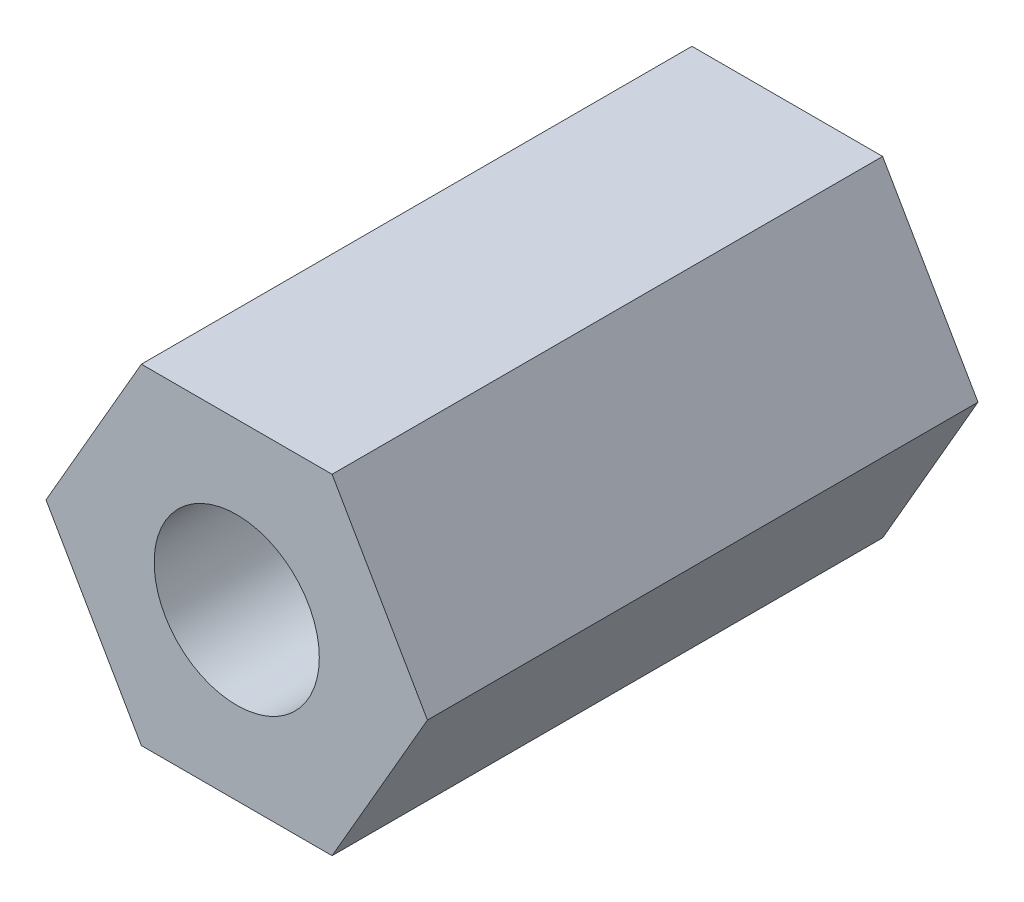
ISO-10303-21;
HEADER;
FILE_DESCRIPTION(('STEP AP214'),'2;1');
FILE_NAME('part.step','',(''),(''),'','','');
FILE_SCHEMA(('AUTOMOTIVE_DESIGN { 1 0 10303 214 1 1 1 1 }'));
ENDSEC;
DATA;
#1=APPLICATION_CONTEXT('core data for automotive mechanical design processes');
#2=APPLICATION_PROTOCOL_DEFINITION('international standard','automotive_design',2000,#1);
#3=PRODUCT_CONTEXT('',#1,'mechanical');
#4=PRODUCT('Part','Part','',(#3));
#5=PRODUCT_RELATED_PRODUCT_CATEGORY('part','',(#4));
#6=PRODUCT_DEFINITION_FORMATION('','',#4);
#7=PRODUCT_DEFINITION_CONTEXT('part definition',#1,'design');
#8=PRODUCT_DEFINITION('design','',#6,#7);
#9=PRODUCT_DEFINITION_SHAPE('','',#8);
#10=(LENGTH_UNIT() NAMED_UNIT(*) SI_UNIT(.MILLI.,.METRE.));
#11=(NAMED_UNIT(*) PLANE_ANGLE_UNIT() SI_UNIT($,.RADIAN.));
#12=(NAMED_UNIT(*) SI_UNIT($,.STERADIAN.) SOLID_ANGLE_UNIT());
#13=UNCERTAINTY_MEASURE_WITH_UNIT(LENGTH_MEASURE(1.E-05),#10,'distance_accuracy_value','');
#14=(GEOMETRIC_REPRESENTATION_CONTEXT(3) GLOBAL_UNCERTAINTY_ASSIGNED_CONTEXT((#13)) GLOBAL_UNIT_ASSIGNED_CONTEXT((#10,
#11,#12)) REPRESENTATION_CONTEXT('',''));
#15=CARTESIAN_POINT('',(0.,0.,0.));
#16=DIRECTION('',(0.,0.,1.));
#17=DIRECTION('',(1.,0.,0.));
#18=AXIS2_PLACEMENT_3D('',#15,#16,#17);
#19=CARTESIAN_POINT('',(0.,0.,10.));
#20=DIRECTION('',(0.,0.,1.));
#21=DIRECTION('',(1.,0.,0.));
#22=AXIS2_PLACEMENT_3D('',#19,#20,#21);
#23=PLANE('',#22);
#24=DIRECTION('',(0.5,0.866025403784439,0.));
#25=VECTOR('',#24,1.);
#26=CARTESIAN_POINT('',(1.73205080756888,-3.,10.));
#27=LINE('',#26,#25);
#28=CARTESIAN_POINT('',(1.73205080756888,-3.,10.));
#29=VERTEX_POINT('',#28);
#30=CARTESIAN_POINT('',(3.46410161513775,0.,10.));
#31=VERTEX_POINT('',#30);
#32=EDGE_CURVE('E130',#29,#31,#27,.T.);
#33=ORIENTED_EDGE('',*,*,#32,.T.);
#34=DIRECTION('',(-0.5,0.866025403784439,0.));
#35=VECTOR('',#34,1.);
#36=CARTESIAN_POINT('',(3.46410161513775,0.,10.));
#37=LINE('',#36,#35);
#38=CARTESIAN_POINT('',(1.73205080756888,3.,10.));
#39=VERTEX_POINT('',#38);
#40=EDGE_CURVE('E88',#31,#39,#37,.T.);
#41=ORIENTED_EDGE('',*,*,#40,.T.);
#42=DIRECTION('',(-1.,0.,0.));
#43=VECTOR('',#42,1.);
#44=CARTESIAN_POINT('',(1.73205080756888,3.,10.));
#45=LINE('',#44,#43);
#46=CARTESIAN_POINT('',(-1.73205080756888,3.,10.));
#47=VERTEX_POINT('',#46);
#48=EDGE_CURVE('E101',#39,#47,#45,.T.);
#49=ORIENTED_EDGE('',*,*,#48,.T.);
#50=DIRECTION('',(-0.5,-0.866025403784439,0.));
#51=VECTOR('',#50,1.);
#52=CARTESIAN_POINT('',(-1.73205080756888,3.,10.));
#53=LINE('',#52,#51);
#54=CARTESIAN_POINT('',(-3.46410161513775,0.,10.));
#55=VERTEX_POINT('',#54);
#56=EDGE_CURVE('E95',#47,#55,#53,.T.);
#57=ORIENTED_EDGE('',*,*,#56,.T.);
#58=DIRECTION('',(0.5,-0.866025403784439,0.));
#59=VECTOR('',#58,1.);
#60=CARTESIAN_POINT('',(-3.46410161513775,0.,10.));
#61=LINE('',#60,#59);
#62=CARTESIAN_POINT('',(-1.73205080756888,-3.,10.));
#63=VERTEX_POINT('',#62);
#64=EDGE_CURVE('E99',#55,#63,#61,.T.);
#65=ORIENTED_EDGE('',*,*,#64,.T.);
#66=DIRECTION('',(1.,0.,0.));
#67=VECTOR('',#66,1.);
#68=CARTESIAN_POINT('',(-1.73205080756888,-3.,10.));
#69=LINE('',#68,#67);
#70=EDGE_CURVE('E51',#63,#29,#69,.T.);
#71=ORIENTED_EDGE('',*,*,#70,.T.);
#72=EDGE_LOOP('',(#33,#41,#49,#57,#65,#71));
#73=FACE_BOUND('',#72,.T.);
#74=CARTESIAN_POINT('',(0.,0.,10.));
#75=DIRECTION('',(0.,0.,1.));
#76=DIRECTION('',(1.,0.,0.));
#77=AXIS2_PLACEMENT_3D('',#74,#75,#76);
#78=CIRCLE('',#77,1.5);
#79=CARTESIAN_POINT('',(1.5,0.,10.));
#80=VERTEX_POINT('',#79);
#81=EDGE_CURVE('E123',#80,#80,#78,.T.);
#82=ORIENTED_EDGE('',*,*,#81,.F.);
#83=EDGE_LOOP('',(#82));
#84=FACE_BOUND('',#83,.T.);
#85=ADVANCED_FACE('F34',(#73,#84),#23,.T.);
#86=CARTESIAN_POINT('',(0.,0.,0.));
#87=DIRECTION('',(0.,0.,1.));
#88=DIRECTION('',(1.,0.,0.));
#89=AXIS2_PLACEMENT_3D('',#86,#87,#88);
#90=PLANE('',#89);
#91=DIRECTION('',(0.5,0.866025403784439,0.));
#92=VECTOR('',#91,1.);
#93=CARTESIAN_POINT('',(1.73205080756888,-3.,0.));
#94=LINE('',#93,#92);
#95=CARTESIAN_POINT('',(1.73205080756888,-3.,0.));
#96=VERTEX_POINT('',#95);
#97=CARTESIAN_POINT('',(3.46410161513775,0.,0.));
#98=VERTEX_POINT('',#97);
#99=EDGE_CURVE('E119',#96,#98,#94,.T.);
#100=ORIENTED_EDGE('',*,*,#99,.F.);
#101=DIRECTION('',(1.,0.,0.));
#102=VECTOR('',#101,1.);
#103=CARTESIAN_POINT('',(-1.73205080756888,-3.,0.));
#104=LINE('',#103,#102);
#105=CARTESIAN_POINT('',(-1.73205080756888,-3.,0.));
#106=VERTEX_POINT('',#105);
#107=EDGE_CURVE('E80',#106,#96,#104,.T.);
#108=ORIENTED_EDGE('',*,*,#107,.F.);
#109=DIRECTION('',(0.5,-0.866025403784439,0.));
#110=VECTOR('',#109,1.);
#111=CARTESIAN_POINT('',(-3.46410161513775,0.,0.));
#112=LINE('',#111,#110);
#113=CARTESIAN_POINT('',(-3.46410161513775,0.,0.));
#114=VERTEX_POINT('',#113);
#115=EDGE_CURVE('E74',#114,#106,#112,.T.);
#116=ORIENTED_EDGE('',*,*,#115,.F.);
#117=DIRECTION('',(-0.5,-0.866025403784439,0.));
#118=VECTOR('',#117,1.);
#119=CARTESIAN_POINT('',(-1.73205080756888,3.,0.));
#120=LINE('',#119,#118);
#121=CARTESIAN_POINT('',(-1.73205080756888,3.,0.));
#122=VERTEX_POINT('',#121);
#123=EDGE_CURVE('E109',#122,#114,#120,.T.);
#124=ORIENTED_EDGE('',*,*,#123,.F.);
#125=DIRECTION('',(-1.,0.,0.));
#126=VECTOR('',#125,1.);
#127=CARTESIAN_POINT('',(1.73205080756888,3.,0.));
#128=LINE('',#127,#126);
#129=CARTESIAN_POINT('',(1.73205080756888,3.,0.));
#130=VERTEX_POINT('',#129);
#131=EDGE_CURVE('E125',#130,#122,#128,.T.);
#132=ORIENTED_EDGE('',*,*,#131,.F.);
#133=DIRECTION('',(-0.5,0.866025403784439,0.));
#134=VECTOR('',#133,1.);
#135=CARTESIAN_POINT('',(3.46410161513775,0.,0.));
#136=LINE('',#135,#134);
#137=EDGE_CURVE('E122',#98,#130,#136,.T.);
#138=ORIENTED_EDGE('',*,*,#137,.F.);
#139=EDGE_LOOP('',(#100,#108,#116,#124,#132,#138));
#140=FACE_BOUND('',#139,.T.);
#141=CARTESIAN_POINT('',(0.,0.,0.));
#142=DIRECTION('',(0.,0.,1.));
#143=DIRECTION('',(1.,0.,0.));
#144=AXIS2_PLACEMENT_3D('',#141,#142,#143);
#145=CIRCLE('',#144,1.5);
#146=CARTESIAN_POINT('',(1.5,0.,0.));
#147=VERTEX_POINT('',#146);
#148=EDGE_CURVE('E223',#147,#147,#145,.T.);
#149=ORIENTED_EDGE('',*,*,#148,.T.);
#150=EDGE_LOOP('',(#149));
#151=FACE_BOUND('',#150,.T.);
#152=ADVANCED_FACE('F139',(#140,#151),#90,.F.);
#153=CARTESIAN_POINT('',(1.73205080756888,-3.,10.));
#154=DIRECTION('',(-0.866025403784439,0.5,0.));
#155=DIRECTION('',(-0.5,-0.866025403784439,0.));
#156=AXIS2_PLACEMENT_3D('',#153,#154,#155);
#157=PLANE('',#156);
#158=ORIENTED_EDGE('',*,*,#99,.T.);
#159=DIRECTION('',(0.,0.,-1.));
#160=VECTOR('',#159,1.);
#161=CARTESIAN_POINT('',(3.46410161513775,0.,10.));
#162=LINE('',#161,#160);
#163=EDGE_CURVE('E11',#31,#98,#162,.T.);
#164=ORIENTED_EDGE('',*,*,#163,.F.);
#165=ORIENTED_EDGE('',*,*,#32,.F.);
#166=DIRECTION('',(0.,0.,-1.));
#167=VECTOR('',#166,1.);
#168=CARTESIAN_POINT('',(1.73205080756888,-3.,10.));
#169=LINE('',#168,#167);
#170=EDGE_CURVE('E115',#29,#96,#169,.T.);
#171=ORIENTED_EDGE('',*,*,#170,.T.);
#172=EDGE_LOOP('',(#158,#164,#165,#171));
#173=FACE_BOUND('',#172,.T.);
#174=ADVANCED_FACE('F36',(#173),#157,.F.);
#175=CARTESIAN_POINT('',(3.46410161513775,0.,10.));
#176=DIRECTION('',(-0.866025403784439,-0.5,0.));
#177=DIRECTION('',(0.5,-0.866025403784439,0.));
#178=AXIS2_PLACEMENT_3D('',#175,#176,#177);
#179=PLANE('',#178);
#180=ORIENTED_EDGE('',*,*,#137,.T.);
#181=DIRECTION('',(0.,0.,-1.));
#182=VECTOR('',#181,1.);
#183=CARTESIAN_POINT('',(1.73205080756888,3.,10.));
#184=LINE('',#183,#182);
#185=EDGE_CURVE('E43',#39,#130,#184,.T.);
#186=ORIENTED_EDGE('',*,*,#185,.F.);
#187=ORIENTED_EDGE('',*,*,#40,.F.);
#188=ORIENTED_EDGE('',*,*,#163,.T.);
#189=EDGE_LOOP('',(#180,#186,#187,#188));
#190=FACE_BOUND('',#189,.T.);
#191=ADVANCED_FACE('F164',(#190),#179,.F.);
#192=CARTESIAN_POINT('',(1.73205080756888,3.,10.));
#193=DIRECTION('',(0.,-1.,0.));
#194=DIRECTION('',(0.,0.,-1.));
#195=AXIS2_PLACEMENT_3D('',#192,#193,#194);
#196=PLANE('',#195);
#197=ORIENTED_EDGE('',*,*,#131,.T.);
#198=DIRECTION('',(0.,0.,-1.));
#199=VECTOR('',#198,1.);
#200=CARTESIAN_POINT('',(-1.73205080756888,3.,10.));
#201=LINE('',#200,#199);
#202=EDGE_CURVE('E110',#47,#122,#201,.T.);
#203=ORIENTED_EDGE('',*,*,#202,.F.);
#204=ORIENTED_EDGE('',*,*,#48,.F.);
#205=ORIENTED_EDGE('',*,*,#185,.T.);
#206=EDGE_LOOP('',(#197,#203,#204,#205));
#207=FACE_BOUND('',#206,.T.);
#208=ADVANCED_FACE('F136',(#207),#196,.F.);
#209=CARTESIAN_POINT('',(-1.73205080756888,3.,10.));
#210=DIRECTION('',(0.866025403784439,-0.5,0.));
#211=DIRECTION('',(0.5,0.866025403784439,0.));
#212=AXIS2_PLACEMENT_3D('',#209,#210,#211);
#213=PLANE('',#212);
#214=ORIENTED_EDGE('',*,*,#123,.T.);
#215=DIRECTION('',(0.,0.,-1.));
#216=VECTOR('',#215,1.);
#217=CARTESIAN_POINT('',(-3.46410161513775,0.,10.));
#218=LINE('',#217,#216);
#219=EDGE_CURVE('E106',#55,#114,#218,.T.);
#220=ORIENTED_EDGE('',*,*,#219,.F.);
#221=ORIENTED_EDGE('',*,*,#56,.F.);
#222=ORIENTED_EDGE('',*,*,#202,.T.);
#223=EDGE_LOOP('',(#214,#220,#221,#222));
#224=FACE_BOUND('',#223,.T.);
#225=ADVANCED_FACE('F107',(#224),#213,.F.);
#226=CARTESIAN_POINT('',(-3.46410161513775,0.,10.));
#227=DIRECTION('',(0.866025403784439,0.5,0.));
#228=DIRECTION('',(-0.5,0.866025403784439,0.));
#229=AXIS2_PLACEMENT_3D('',#226,#227,#228);
#230=PLANE('',#229);
#231=ORIENTED_EDGE('',*,*,#115,.T.);
#232=DIRECTION('',(0.,0.,-1.));
#233=VECTOR('',#232,1.);
#234=CARTESIAN_POINT('',(-1.73205080756888,-3.,10.));
#235=LINE('',#234,#233);
#236=EDGE_CURVE('E111',#63,#106,#235,.T.);
#237=ORIENTED_EDGE('',*,*,#236,.F.);
#238=ORIENTED_EDGE('',*,*,#64,.F.);
#239=ORIENTED_EDGE('',*,*,#219,.T.);
#240=EDGE_LOOP('',(#231,#237,#238,#239));
#241=FACE_BOUND('',#240,.T.);
#242=ADVANCED_FACE('F113',(#241),#230,.F.);
#243=CARTESIAN_POINT('',(-1.73205080756888,-3.,10.));
#244=DIRECTION('',(0.,1.,0.));
#245=DIRECTION('',(0.,0.,1.));
#246=AXIS2_PLACEMENT_3D('',#243,#244,#245);
#247=PLANE('',#246);
#248=ORIENTED_EDGE('',*,*,#107,.T.);
#249=ORIENTED_EDGE('',*,*,#170,.F.);
#250=ORIENTED_EDGE('',*,*,#70,.F.);
#251=ORIENTED_EDGE('',*,*,#236,.T.);
#252=EDGE_LOOP('',(#248,#249,#250,#251));
#253=FACE_BOUND('',#252,.T.);
#254=ADVANCED_FACE('F144',(#253),#247,.F.);
#255=CARTESIAN_POINT('',(0.,0.,10.));
#256=DIRECTION('',(0.,0.,-1.));
#257=DIRECTION('',(-1.,0.,0.));
#258=AXIS2_PLACEMENT_3D('',#255,#256,#257);
#259=CYLINDRICAL_SURFACE('',#258,1.5);
#260=ORIENTED_EDGE('',*,*,#81,.T.);
#261=EDGE_LOOP('',(#260));
#262=FACE_BOUND('',#261,.T.);
#263=ORIENTED_EDGE('',*,*,#148,.F.);
#264=EDGE_LOOP('',(#263));
#265=FACE_BOUND('',#264,.T.);
#266=ADVANCED_FACE('F146',(#262,#265),#259,.F.);
#267=CLOSED_SHELL('',(#85,#152,#174,#191,#208,#225,#242,#254,#266));
#268=MANIFOLD_SOLID_BREP('B2',#267);
#269=ADVANCED_BREP_SHAPE_REPRESENTATION('',(#18,#268),#14);
#270=SHAPE_DEFINITION_REPRESENTATION(#9,#269);
ENDSEC;
END-ISO-10303-21;
